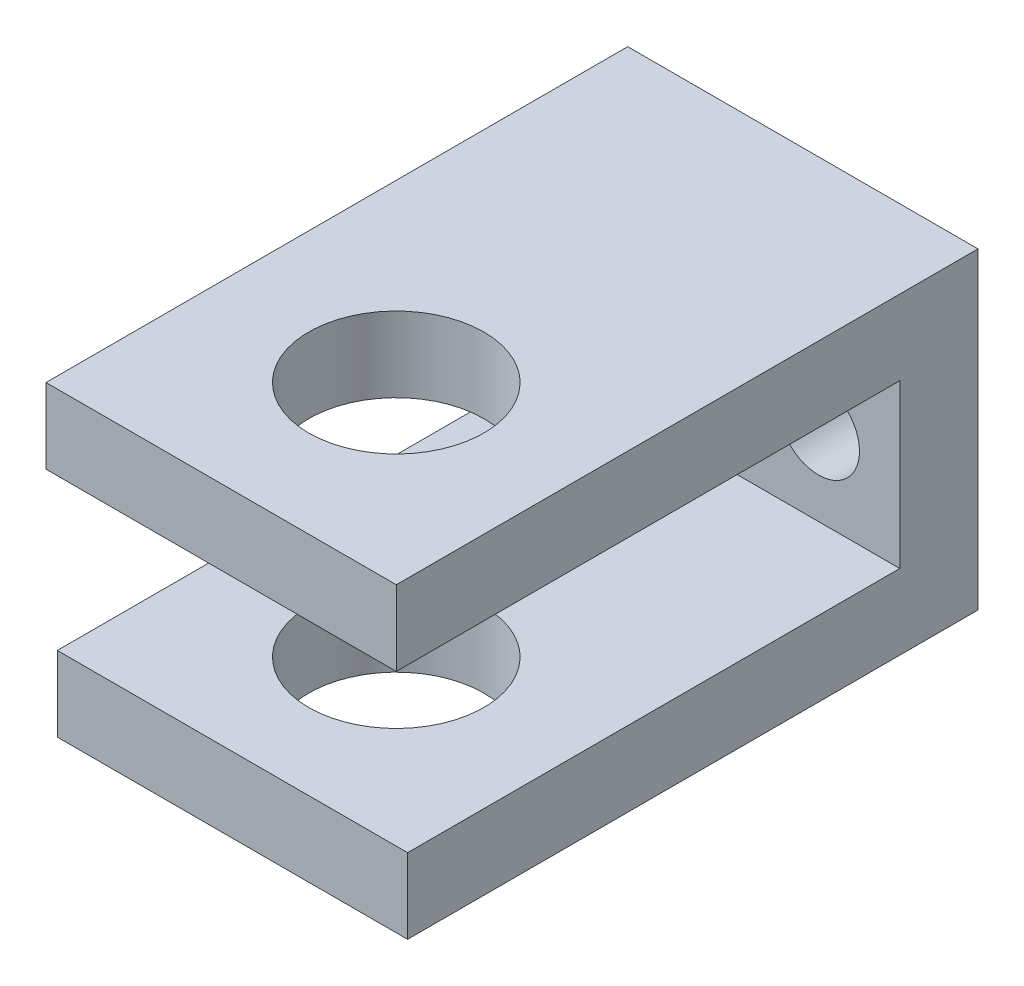
ISO-10303-21;
HEADER;
FILE_DESCRIPTION(('STEP AP214'),'2;1');
FILE_NAME('part.step','',(''),(''),'','','');
FILE_SCHEMA(('AUTOMOTIVE_DESIGN { 1 0 10303 214 1 1 1 1 }'));
ENDSEC;
DATA;
#1=APPLICATION_CONTEXT('core data for automotive mechanical design processes');
#2=APPLICATION_PROTOCOL_DEFINITION('international standard','automotive_design',2000,#1);
#3=PRODUCT_CONTEXT('',#1,'mechanical');
#4=PRODUCT('Part','Part','',(#3));
#5=PRODUCT_RELATED_PRODUCT_CATEGORY('part','',(#4));
#6=PRODUCT_DEFINITION_FORMATION('','',#4);
#7=PRODUCT_DEFINITION_CONTEXT('part definition',#1,'design');
#8=PRODUCT_DEFINITION('design','',#6,#7);
#9=PRODUCT_DEFINITION_SHAPE('','',#8);
#10=(LENGTH_UNIT() NAMED_UNIT(*) SI_UNIT(.MILLI.,.METRE.));
#11=(NAMED_UNIT(*) PLANE_ANGLE_UNIT() SI_UNIT($,.RADIAN.));
#12=(NAMED_UNIT(*) SI_UNIT($,.STERADIAN.) SOLID_ANGLE_UNIT());
#13=UNCERTAINTY_MEASURE_WITH_UNIT(LENGTH_MEASURE(1.E-05),#10,'distance_accuracy_value','');
#14=(GEOMETRIC_REPRESENTATION_CONTEXT(3) GLOBAL_UNCERTAINTY_ASSIGNED_CONTEXT((#13)) GLOBAL_UNIT_ASSIGNED_CONTEXT((#10,
#11,#12)) REPRESENTATION_CONTEXT('',''));
#15=CARTESIAN_POINT('',(0.,0.,0.));
#16=DIRECTION('',(0.,0.,1.));
#17=DIRECTION('',(1.,0.,0.));
#18=AXIS2_PLACEMENT_3D('',#15,#16,#17);
#19=CARTESIAN_POINT('',(7.112,0.,-11.811));
#20=DIRECTION('',(0.,-1.,0.));
#21=DIRECTION('',(0.,0.,-1.));
#22=AXIS2_PLACEMENT_3D('',#19,#20,#21);
#23=PLANE('',#22);
#24=CARTESIAN_POINT('',(0.,0.,4.699));
#25=DIRECTION('',(0.,-1.,0.));
#26=DIRECTION('',(0.,0.,-1.));
#27=AXIS2_PLACEMENT_3D('',#24,#25,#26);
#28=CIRCLE('',#27,3.556);
#29=CARTESIAN_POINT('',(0.,0.,1.143));
#30=VERTEX_POINT('',#29);
#31=EDGE_CURVE('E134',#30,#30,#28,.T.);
#32=ORIENTED_EDGE('',*,*,#31,.F.);
#33=EDGE_LOOP('',(#32));
#34=FACE_BOUND('',#33,.T.);
#35=DIRECTION('',(0.,0.,1.));
#36=VECTOR('',#35,1.);
#37=CARTESIAN_POINT('',(-7.112,0.,11.811));
#38=LINE('',#37,#36);
#39=CARTESIAN_POINT('',(-7.112,0.,-8.636));
#40=VERTEX_POINT('',#39);
#41=CARTESIAN_POINT('',(-7.112,0.,11.811));
#42=VERTEX_POINT('',#41);
#43=EDGE_CURVE('E194',#40,#42,#38,.T.);
#44=ORIENTED_EDGE('',*,*,#43,.F.);
#45=DIRECTION('',(1.,0.,0.));
#46=VECTOR('',#45,1.);
#47=CARTESIAN_POINT('',(-7.112,0.,-8.636));
#48=LINE('',#47,#46);
#49=CARTESIAN_POINT('',(7.112,0.,-8.636));
#50=VERTEX_POINT('',#49);
#51=EDGE_CURVE('E159',#40,#50,#48,.T.);
#52=ORIENTED_EDGE('',*,*,#51,.T.);
#53=DIRECTION('',(0.,0.,-1.));
#54=VECTOR('',#53,1.);
#55=CARTESIAN_POINT('',(7.112,0.,11.811));
#56=LINE('',#55,#54);
#57=CARTESIAN_POINT('',(7.112,0.,11.811));
#58=VERTEX_POINT('',#57);
#59=EDGE_CURVE('E158',#58,#50,#56,.T.);
#60=ORIENTED_EDGE('',*,*,#59,.F.);
#61=DIRECTION('',(1.,0.,0.));
#62=VECTOR('',#61,1.);
#63=CARTESIAN_POINT('',(-7.112,0.,11.811));
#64=LINE('',#63,#62);
#65=EDGE_CURVE('E73',#42,#58,#64,.T.);
#66=ORIENTED_EDGE('',*,*,#65,.F.);
#67=EDGE_LOOP('',(#44,#52,#60,#66));
#68=FACE_BOUND('',#67,.T.);
#69=ADVANCED_FACE('F32',(#34,#68),#23,.T.);
#70=CARTESIAN_POINT('',(7.112,3.048,11.811));
#71=DIRECTION('',(-1.,0.,0.));
#72=DIRECTION('',(0.,0.,1.));
#73=AXIS2_PLACEMENT_3D('',#70,#71,#72);
#74=PLANE('',#73);
#75=ORIENTED_EDGE('',*,*,#59,.T.);
#76=DIRECTION('',(0.,-1.,0.));
#77=VECTOR('',#76,1.);
#78=CARTESIAN_POINT('',(7.112,0.,-8.636));
#79=LINE('',#78,#77);
#80=CARTESIAN_POINT('',(7.112,-6.604,-8.636));
#81=VERTEX_POINT('',#80);
#82=EDGE_CURVE('E49',#50,#81,#79,.T.);
#83=ORIENTED_EDGE('',*,*,#82,.T.);
#84=DIRECTION('',(0.,0.,1.));
#85=VECTOR('',#84,1.);
#86=CARTESIAN_POINT('',(7.112,-6.604,-11.811));
#87=LINE('',#86,#85);
#88=CARTESIAN_POINT('',(7.11199999999999,-6.604,11.3516723576704));
#89=VERTEX_POINT('',#88);
#90=EDGE_CURVE('E131',#81,#89,#87,.T.);
#91=ORIENTED_EDGE('',*,*,#90,.T.);
#92=DIRECTION('',(0.,1.,0.));
#93=VECTOR('',#92,1.);
#94=CARTESIAN_POINT('',(7.11199999999999,-9.652,11.3516723576704));
#95=LINE('',#94,#93);
#96=CARTESIAN_POINT('',(7.11199999999999,-9.652,11.3516723576704));
#97=VERTEX_POINT('',#96);
#98=EDGE_CURVE('E148',#97,#89,#95,.T.);
#99=ORIENTED_EDGE('',*,*,#98,.F.);
#100=DIRECTION('',(0.,0.,1.));
#101=VECTOR('',#100,1.);
#102=CARTESIAN_POINT('',(7.112,-9.652,-11.811));
#103=LINE('',#102,#101);
#104=CARTESIAN_POINT('',(7.112,-9.652,-11.811));
#105=VERTEX_POINT('',#104);
#106=EDGE_CURVE('E123',#105,#97,#103,.T.);
#107=ORIENTED_EDGE('',*,*,#106,.F.);
#108=DIRECTION('',(0.,-1.,0.));
#109=VECTOR('',#108,1.);
#110=CARTESIAN_POINT('',(7.112,3.048,-11.811));
#111=LINE('',#110,#109);
#112=CARTESIAN_POINT('',(7.112,3.048,-11.811));
#113=VERTEX_POINT('',#112);
#114=EDGE_CURVE('E11',#113,#105,#111,.T.);
#115=ORIENTED_EDGE('',*,*,#114,.F.);
#116=DIRECTION('',(0.,0.,-1.));
#117=VECTOR('',#116,1.);
#118=CARTESIAN_POINT('',(7.112,3.048,11.811));
#119=LINE('',#118,#117);
#120=CARTESIAN_POINT('',(7.112,3.048,11.811));
#121=VERTEX_POINT('',#120);
#122=EDGE_CURVE('E199',#121,#113,#119,.T.);
#123=ORIENTED_EDGE('',*,*,#122,.F.);
#124=DIRECTION('',(0.,-1.,0.));
#125=VECTOR('',#124,1.);
#126=CARTESIAN_POINT('',(7.112,3.048,11.811));
#127=LINE('',#126,#125);
#128=EDGE_CURVE('E210',#121,#58,#127,.T.);
#129=ORIENTED_EDGE('',*,*,#128,.T.);
#130=EDGE_LOOP('',(#75,#83,#91,#99,#107,#115,#123,#129));
#131=FACE_BOUND('',#130,.T.);
#132=ADVANCED_FACE('F34',(#131),#74,.F.);
#133=CARTESIAN_POINT('',(-7.112,3.048,-11.811));
#134=DIRECTION('',(0.,0.,1.));
#135=DIRECTION('',(1.,0.,0.));
#136=AXIS2_PLACEMENT_3D('',#133,#134,#135);
#137=PLANE('',#136);
#138=CARTESIAN_POINT('',(-3.81,-3.302,-11.811));
#139=DIRECTION('',(0.,0.,-1.));
#140=DIRECTION('',(-1.,0.,0.));
#141=AXIS2_PLACEMENT_3D('',#138,#139,#140);
#142=CIRCLE('',#141,1.6637);
#143=CARTESIAN_POINT('',(-5.4737,-3.302,-11.811));
#144=VERTEX_POINT('',#143);
#145=EDGE_CURVE('E176',#144,#144,#142,.T.);
#146=ORIENTED_EDGE('',*,*,#145,.F.);
#147=EDGE_LOOP('',(#146));
#148=FACE_BOUND('',#147,.T.);
#149=CARTESIAN_POINT('',(3.81,-3.302,-11.811));
#150=DIRECTION('',(0.,0.,-1.));
#151=DIRECTION('',(-1.,0.,0.));
#152=AXIS2_PLACEMENT_3D('',#149,#150,#151);
#153=CIRCLE('',#152,1.6637);
#154=CARTESIAN_POINT('',(2.1463,-3.302,-11.811));
#155=VERTEX_POINT('',#154);
#156=EDGE_CURVE('E165',#155,#155,#153,.T.);
#157=ORIENTED_EDGE('',*,*,#156,.F.);
#158=EDGE_LOOP('',(#157));
#159=FACE_BOUND('',#158,.T.);
#160=ORIENTED_EDGE('',*,*,#114,.T.);
#161=DIRECTION('',(1.,0.,0.));
#162=VECTOR('',#161,1.);
#163=CARTESIAN_POINT('',(-7.112,-9.652,-11.811));
#164=LINE('',#163,#162);
#165=CARTESIAN_POINT('',(-7.112,-9.652,-11.811));
#166=VERTEX_POINT('',#165);
#167=EDGE_CURVE('E118',#166,#105,#164,.T.);
#168=ORIENTED_EDGE('',*,*,#167,.F.);
#169=DIRECTION('',(0.,-1.,0.));
#170=VECTOR('',#169,1.);
#171=CARTESIAN_POINT('',(-7.112,3.048,-11.811));
#172=LINE('',#171,#170);
#173=CARTESIAN_POINT('',(-7.112,3.048,-11.811));
#174=VERTEX_POINT('',#173);
#175=EDGE_CURVE('E41',#174,#166,#172,.T.);
#176=ORIENTED_EDGE('',*,*,#175,.F.);
#177=DIRECTION('',(-1.,0.,0.));
#178=VECTOR('',#177,1.);
#179=CARTESIAN_POINT('',(-7.112,3.048,-11.811));
#180=LINE('',#179,#178);
#181=EDGE_CURVE('E80',#113,#174,#180,.T.);
#182=ORIENTED_EDGE('',*,*,#181,.F.);
#183=EDGE_LOOP('',(#160,#168,#176,#182));
#184=FACE_BOUND('',#183,.T.);
#185=ADVANCED_FACE('F119',(#148,#159,#184),#137,.F.);
#186=CARTESIAN_POINT('',(-7.112,3.048,11.811));
#187=DIRECTION('',(1.,0.,0.));
#188=DIRECTION('',(0.,0.,-1.));
#189=AXIS2_PLACEMENT_3D('',#186,#187,#188);
#190=PLANE('',#189);
#191=ORIENTED_EDGE('',*,*,#175,.T.);
#192=DIRECTION('',(0.,0.,-1.));
#193=VECTOR('',#192,1.);
#194=CARTESIAN_POINT('',(-7.112,-9.652,-11.811));
#195=LINE('',#194,#193);
#196=CARTESIAN_POINT('',(-7.11200000000001,-9.652,11.3516723576704));
#197=VERTEX_POINT('',#196);
#198=EDGE_CURVE('E112',#197,#166,#195,.T.);
#199=ORIENTED_EDGE('',*,*,#198,.F.);
#200=DIRECTION('',(0.,1.,0.));
#201=VECTOR('',#200,1.);
#202=CARTESIAN_POINT('',(-7.11200000000001,-9.652,11.3516723576704));
#203=LINE('',#202,#201);
#204=CARTESIAN_POINT('',(-7.11200000000001,-6.604,11.3516723576704));
#205=VERTEX_POINT('',#204);
#206=EDGE_CURVE('E139',#197,#205,#203,.T.);
#207=ORIENTED_EDGE('',*,*,#206,.T.);
#208=DIRECTION('',(0.,0.,-1.));
#209=VECTOR('',#208,1.);
#210=CARTESIAN_POINT('',(-7.112,-6.604,-11.811));
#211=LINE('',#210,#209);
#212=CARTESIAN_POINT('',(-7.112,-6.604,-8.636));
#213=VERTEX_POINT('',#212);
#214=EDGE_CURVE('E144',#205,#213,#211,.T.);
#215=ORIENTED_EDGE('',*,*,#214,.T.);
#216=DIRECTION('',(0.,-1.,0.));
#217=VECTOR('',#216,1.);
#218=CARTESIAN_POINT('',(-7.112,0.,-8.636));
#219=LINE('',#218,#217);
#220=EDGE_CURVE('E228',#40,#213,#219,.T.);
#221=ORIENTED_EDGE('',*,*,#220,.F.);
#222=ORIENTED_EDGE('',*,*,#43,.T.);
#223=DIRECTION('',(0.,-1.,0.));
#224=VECTOR('',#223,1.);
#225=CARTESIAN_POINT('',(-7.112,3.048,11.811));
#226=LINE('',#225,#224);
#227=CARTESIAN_POINT('',(-7.112,3.048,11.811));
#228=VERTEX_POINT('',#227);
#229=EDGE_CURVE('E115',#228,#42,#226,.T.);
#230=ORIENTED_EDGE('',*,*,#229,.F.);
#231=DIRECTION('',(0.,0.,1.));
#232=VECTOR('',#231,1.);
#233=CARTESIAN_POINT('',(-7.112,3.048,11.811));
#234=LINE('',#233,#232);
#235=EDGE_CURVE('E114',#174,#228,#234,.T.);
#236=ORIENTED_EDGE('',*,*,#235,.F.);
#237=EDGE_LOOP('',(#191,#199,#207,#215,#221,#222,#230,#236));
#238=FACE_BOUND('',#237,.T.);
#239=ADVANCED_FACE('F109',(#238),#190,.F.);
#240=CARTESIAN_POINT('',(-7.112,3.048,11.811));
#241=DIRECTION('',(0.,0.,-1.));
#242=DIRECTION('',(-1.,0.,0.));
#243=AXIS2_PLACEMENT_3D('',#240,#241,#242);
#244=PLANE('',#243);
#245=ORIENTED_EDGE('',*,*,#65,.T.);
#246=ORIENTED_EDGE('',*,*,#128,.F.);
#247=DIRECTION('',(1.,0.,0.));
#248=VECTOR('',#247,1.);
#249=CARTESIAN_POINT('',(-7.112,3.048,11.811));
#250=LINE('',#249,#248);
#251=EDGE_CURVE('E58',#228,#121,#250,.T.);
#252=ORIENTED_EDGE('',*,*,#251,.F.);
#253=ORIENTED_EDGE('',*,*,#229,.T.);
#254=EDGE_LOOP('',(#245,#246,#252,#253));
#255=FACE_BOUND('',#254,.T.);
#256=ADVANCED_FACE('F212',(#255),#244,.F.);
#257=CARTESIAN_POINT('',(7.112,3.048,-11.811));
#258=DIRECTION('',(0.,-1.,0.));
#259=DIRECTION('',(0.,0.,-1.));
#260=AXIS2_PLACEMENT_3D('',#257,#258,#259);
#261=PLANE('',#260);
#262=CARTESIAN_POINT('',(0.,3.048,4.699));
#263=DIRECTION('',(0.,1.,0.));
#264=DIRECTION('',(0.,0.,1.));
#265=AXIS2_PLACEMENT_3D('',#262,#263,#264);
#266=CIRCLE('',#265,3.556);
#267=CARTESIAN_POINT('',(0.,3.048,8.255));
#268=VERTEX_POINT('',#267);
#269=EDGE_CURVE('E164',#268,#268,#266,.T.);
#270=ORIENTED_EDGE('',*,*,#269,.F.);
#271=EDGE_LOOP('',(#270));
#272=FACE_BOUND('',#271,.T.);
#273=ORIENTED_EDGE('',*,*,#122,.T.);
#274=ORIENTED_EDGE('',*,*,#181,.T.);
#275=ORIENTED_EDGE('',*,*,#235,.T.);
#276=ORIENTED_EDGE('',*,*,#251,.T.);
#277=EDGE_LOOP('',(#273,#274,#275,#276));
#278=FACE_BOUND('',#277,.T.);
#279=ADVANCED_FACE('F216',(#272,#278),#261,.F.);
#280=CARTESIAN_POINT('',(-7.112,0.,-8.636));
#281=DIRECTION('',(0.,0.,1.));
#282=DIRECTION('',(0.,-1.,0.));
#283=AXIS2_PLACEMENT_3D('',#280,#281,#282);
#284=PLANE('',#283);
#285=CARTESIAN_POINT('',(-3.81,-3.302,-8.636));
#286=DIRECTION('',(0.,0.,1.));
#287=DIRECTION('',(0.,-1.,0.));
#288=AXIS2_PLACEMENT_3D('',#285,#286,#287);
#289=CIRCLE('',#288,1.6637);
#290=CARTESIAN_POINT('',(-3.81,-4.9657,-8.636));
#291=VERTEX_POINT('',#290);
#292=EDGE_CURVE('E36',#291,#291,#289,.T.);
#293=ORIENTED_EDGE('',*,*,#292,.F.);
#294=EDGE_LOOP('',(#293));
#295=FACE_BOUND('',#294,.T.);
#296=CARTESIAN_POINT('',(3.81,-3.302,-8.636));
#297=DIRECTION('',(0.,0.,1.));
#298=DIRECTION('',(0.,-1.,0.));
#299=AXIS2_PLACEMENT_3D('',#296,#297,#298);
#300=CIRCLE('',#299,1.6637);
#301=CARTESIAN_POINT('',(3.81,-4.9657,-8.636));
#302=VERTEX_POINT('',#301);
#303=EDGE_CURVE('E162',#302,#302,#300,.T.);
#304=ORIENTED_EDGE('',*,*,#303,.F.);
#305=EDGE_LOOP('',(#304));
#306=FACE_BOUND('',#305,.T.);
#307=ORIENTED_EDGE('',*,*,#82,.F.);
#308=ORIENTED_EDGE('',*,*,#51,.F.);
#309=ORIENTED_EDGE('',*,*,#220,.T.);
#310=DIRECTION('',(1.,0.,0.));
#311=VECTOR('',#310,1.);
#312=CARTESIAN_POINT('',(-7.112,-6.604,-8.636));
#313=LINE('',#312,#311);
#314=EDGE_CURVE('E156',#213,#81,#313,.T.);
#315=ORIENTED_EDGE('',*,*,#314,.T.);
#316=EDGE_LOOP('',(#307,#308,#309,#315));
#317=FACE_BOUND('',#316,.T.);
#318=ADVANCED_FACE('F227',(#295,#306,#317),#284,.T.);
#319=CARTESIAN_POINT('',(-7.11200000000001,-6.604,11.3516723576704));
#320=DIRECTION('',(0.,1.,0.));
#321=DIRECTION('',(0.,0.,1.));
#322=AXIS2_PLACEMENT_3D('',#319,#320,#321);
#323=PLANE('',#322);
#324=CARTESIAN_POINT('',(0.,-6.604,4.699));
#325=DIRECTION('',(0.,1.,0.));
#326=DIRECTION('',(0.,0.,1.));
#327=AXIS2_PLACEMENT_3D('',#324,#325,#326);
#328=CIRCLE('',#327,3.556);
#329=CARTESIAN_POINT('',(0.,-6.604,8.255));
#330=VERTEX_POINT('',#329);
#331=EDGE_CURVE('E180',#330,#330,#328,.T.);
#332=ORIENTED_EDGE('',*,*,#331,.F.);
#333=EDGE_LOOP('',(#332));
#334=FACE_BOUND('',#333,.T.);
#335=ORIENTED_EDGE('',*,*,#314,.F.);
#336=ORIENTED_EDGE('',*,*,#214,.F.);
#337=DIRECTION('',(-1.,0.,0.));
#338=VECTOR('',#337,1.);
#339=CARTESIAN_POINT('',(-7.11200000000001,-6.604,11.3516723576704));
#340=LINE('',#339,#338);
#341=EDGE_CURVE('E129',#89,#205,#340,.T.);
#342=ORIENTED_EDGE('',*,*,#341,.F.);
#343=ORIENTED_EDGE('',*,*,#90,.F.);
#344=EDGE_LOOP('',(#335,#336,#342,#343));
#345=FACE_BOUND('',#344,.T.);
#346=ADVANCED_FACE('F226',(#334,#345),#323,.T.);
#347=CARTESIAN_POINT('',(-7.11200000000001,-9.652,11.3516723576704));
#348=DIRECTION('',(0.,0.,-1.));
#349=DIRECTION('',(0.,1.,0.));
#350=AXIS2_PLACEMENT_3D('',#347,#348,#349);
#351=PLANE('',#350);
#352=ORIENTED_EDGE('',*,*,#341,.T.);
#353=ORIENTED_EDGE('',*,*,#206,.F.);
#354=DIRECTION('',(-1.,0.,0.));
#355=VECTOR('',#354,1.);
#356=CARTESIAN_POINT('',(-7.11200000000001,-9.652,11.3516723576704));
#357=LINE('',#356,#355);
#358=EDGE_CURVE('E127',#97,#197,#357,.T.);
#359=ORIENTED_EDGE('',*,*,#358,.F.);
#360=ORIENTED_EDGE('',*,*,#98,.T.);
#361=EDGE_LOOP('',(#352,#353,#359,#360));
#362=FACE_BOUND('',#361,.T.);
#363=ADVANCED_FACE('F222',(#362),#351,.F.);
#364=CARTESIAN_POINT('',(-7.11200000000001,-9.652,11.3516723576704));
#365=DIRECTION('',(0.,1.,0.));
#366=DIRECTION('',(0.,0.,1.));
#367=AXIS2_PLACEMENT_3D('',#364,#365,#366);
#368=PLANE('',#367);
#369=CARTESIAN_POINT('',(0.,-9.652,4.699));
#370=DIRECTION('',(0.,1.,0.));
#371=DIRECTION('',(0.,0.,1.));
#372=AXIS2_PLACEMENT_3D('',#369,#370,#371);
#373=CIRCLE('',#372,3.556);
#374=CARTESIAN_POINT('',(0.,-9.652,8.255));
#375=VERTEX_POINT('',#374);
#376=EDGE_CURVE('E169',#375,#375,#373,.T.);
#377=ORIENTED_EDGE('',*,*,#376,.T.);
#378=EDGE_LOOP('',(#377));
#379=FACE_BOUND('',#378,.T.);
#380=ORIENTED_EDGE('',*,*,#198,.T.);
#381=ORIENTED_EDGE('',*,*,#167,.T.);
#382=ORIENTED_EDGE('',*,*,#106,.T.);
#383=ORIENTED_EDGE('',*,*,#358,.T.);
#384=EDGE_LOOP('',(#380,#381,#382,#383));
#385=FACE_BOUND('',#384,.T.);
#386=ADVANCED_FACE('F125',(#379,#385),#368,.F.);
#387=CARTESIAN_POINT('',(0.,-9.652,4.699));
#388=DIRECTION('',(0.,1.,0.));
#389=DIRECTION('',(0.,0.,1.));
#390=AXIS2_PLACEMENT_3D('',#387,#388,#389);
#391=CYLINDRICAL_SURFACE('',#390,3.556);
#392=ORIENTED_EDGE('',*,*,#331,.T.);
#393=EDGE_LOOP('',(#392));
#394=FACE_BOUND('',#393,.T.);
#395=ORIENTED_EDGE('',*,*,#376,.F.);
#396=EDGE_LOOP('',(#395));
#397=FACE_BOUND('',#396,.T.);
#398=ADVANCED_FACE('F268',(#394,#397),#391,.F.);
#399=ORIENTED_EDGE('',*,*,#31,.T.);
#400=EDGE_LOOP('',(#399));
#401=FACE_BOUND('',#400,.T.);
#402=ORIENTED_EDGE('',*,*,#269,.T.);
#403=EDGE_LOOP('',(#402));
#404=FACE_BOUND('',#403,.T.);
#405=ADVANCED_FACE('F187',(#401,#404),#391,.F.);
#406=CARTESIAN_POINT('',(3.81,-3.302,11.811025));
#407=DIRECTION('',(0.,0.,-1.));
#408=DIRECTION('',(-1.,0.,0.));
#409=AXIS2_PLACEMENT_3D('',#406,#407,#408);
#410=CYLINDRICAL_SURFACE('',#409,1.6637);
#411=ORIENTED_EDGE('',*,*,#303,.T.);
#412=EDGE_LOOP('',(#411));
#413=FACE_BOUND('',#412,.T.);
#414=ORIENTED_EDGE('',*,*,#156,.T.);
#415=EDGE_LOOP('',(#414));
#416=FACE_BOUND('',#415,.T.);
#417=ADVANCED_FACE('F260',(#413,#416),#410,.F.);
#418=CARTESIAN_POINT('',(-3.81,-3.302,11.811025));
#419=DIRECTION('',(0.,0.,-1.));
#420=DIRECTION('',(-1.,0.,0.));
#421=AXIS2_PLACEMENT_3D('',#418,#419,#420);
#422=CYLINDRICAL_SURFACE('',#421,1.6637);
#423=ORIENTED_EDGE('',*,*,#292,.T.);
#424=EDGE_LOOP('',(#423));
#425=FACE_BOUND('',#424,.T.);
#426=ORIENTED_EDGE('',*,*,#145,.T.);
#427=EDGE_LOOP('',(#426));
#428=FACE_BOUND('',#427,.T.);
#429=ADVANCED_FACE('F258',(#425,#428),#422,.F.);
#430=CLOSED_SHELL('',(#69,#132,#185,#239,#256,#279,#318,#346,#363,#386,#398,#405,#417,#429));
#431=MANIFOLD_SOLID_BREP('B2',#430);
#432=ADVANCED_BREP_SHAPE_REPRESENTATION('',(#18,#431),#14);
#433=SHAPE_DEFINITION_REPRESENTATION(#9,#432);
ENDSEC;
END-ISO-10303-21;
